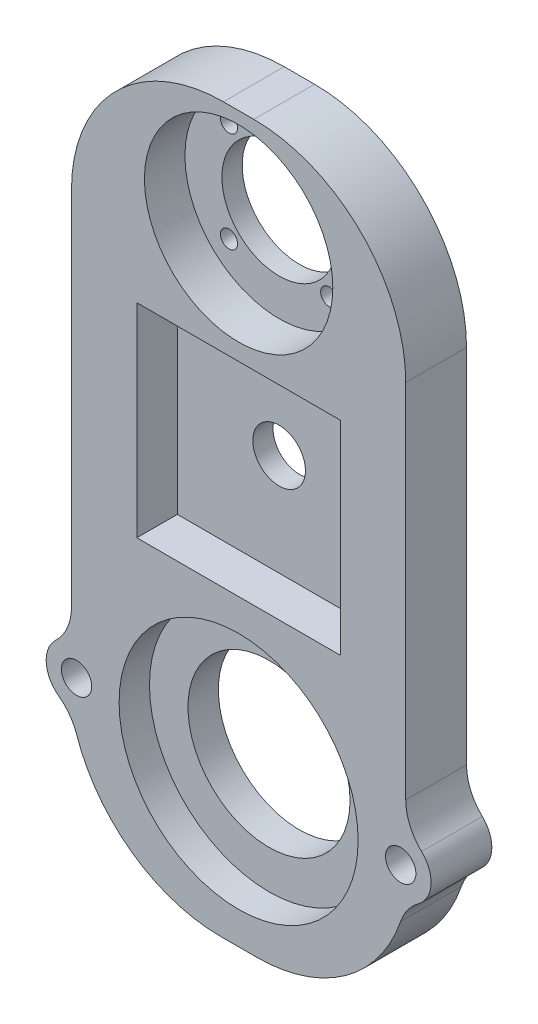
ISO-10303-21;
HEADER;
FILE_DESCRIPTION(('STEP AP214'),'2;1');
FILE_NAME('part.step','',(''),(''),'','','');
FILE_SCHEMA(('AUTOMOTIVE_DESIGN { 1 0 10303 214 1 1 1 1 }'));
ENDSEC;
DATA;
#1=APPLICATION_CONTEXT('core data for automotive mechanical design processes');
#2=APPLICATION_PROTOCOL_DEFINITION('international standard','automotive_design',2000,#1);
#3=PRODUCT_CONTEXT('',#1,'mechanical');
#4=PRODUCT('Part','Part','',(#3));
#5=PRODUCT_RELATED_PRODUCT_CATEGORY('part','',(#4));
#6=PRODUCT_DEFINITION_FORMATION('','',#4);
#7=PRODUCT_DEFINITION_CONTEXT('part definition',#1,'design');
#8=PRODUCT_DEFINITION('design','',#6,#7);
#9=PRODUCT_DEFINITION_SHAPE('','',#8);
#10=(LENGTH_UNIT() NAMED_UNIT(*) SI_UNIT(.MILLI.,.METRE.));
#11=(NAMED_UNIT(*) PLANE_ANGLE_UNIT() SI_UNIT($,.RADIAN.));
#12=(NAMED_UNIT(*) SI_UNIT($,.STERADIAN.) SOLID_ANGLE_UNIT());
#13=UNCERTAINTY_MEASURE_WITH_UNIT(LENGTH_MEASURE(1.E-05),#10,'distance_accuracy_value','');
#14=(GEOMETRIC_REPRESENTATION_CONTEXT(3) GLOBAL_UNCERTAINTY_ASSIGNED_CONTEXT((#13)) GLOBAL_UNIT_ASSIGNED_CONTEXT((#10,
#11,#12)) REPRESENTATION_CONTEXT('',''));
#15=CARTESIAN_POINT('',(0.,0.,0.));
#16=DIRECTION('',(0.,0.,1.));
#17=DIRECTION('',(1.,0.,0.));
#18=AXIS2_PLACEMENT_3D('',#15,#16,#17);
#19=CARTESIAN_POINT('',(33.,113.,12.));
#20=DIRECTION('',(-1.,0.,0.));
#21=DIRECTION('',(0.,-1.,0.));
#22=AXIS2_PLACEMENT_3D('',#19,#20,#21);
#23=PLANE('',#22);
#24=DIRECTION('',(0.,1.,0.));
#25=VECTOR('',#24,1.);
#26=CARTESIAN_POINT('',(33.,113.,12.));
#27=LINE('',#26,#25);
#28=CARTESIAN_POINT('',(33.,11.6189500386222,12.));
#29=VERTEX_POINT('',#28);
#30=CARTESIAN_POINT('',(33.,83.,12.));
#31=VERTEX_POINT('',#30);
#32=EDGE_CURVE('E236',#29,#31,#27,.T.);
#33=ORIENTED_EDGE('',*,*,#32,.F.);
#34=DIRECTION('',(0.,0.,1.));
#35=VECTOR('',#34,1.);
#36=CARTESIAN_POINT('',(33.,11.6189500386222,0.));
#37=LINE('',#36,#35);
#38=CARTESIAN_POINT('',(33.,11.6189500386222,0.));
#39=VERTEX_POINT('',#38);
#40=EDGE_CURVE('E312',#29,#39,#37,.F.);
#41=ORIENTED_EDGE('',*,*,#40,.T.);
#42=DIRECTION('',(0.,1.,0.));
#43=VECTOR('',#42,1.);
#44=CARTESIAN_POINT('',(33.,113.,0.));
#45=LINE('',#44,#43);
#46=CARTESIAN_POINT('',(33.,83.,0.));
#47=VERTEX_POINT('',#46);
#48=EDGE_CURVE('E247',#39,#47,#45,.T.);
#49=ORIENTED_EDGE('',*,*,#48,.T.);
#50=DIRECTION('',(0.,0.,-1.));
#51=VECTOR('',#50,1.);
#52=CARTESIAN_POINT('',(33.,83.,12.));
#53=LINE('',#52,#51);
#54=EDGE_CURVE('E277',#47,#31,#53,.F.);
#55=ORIENTED_EDGE('',*,*,#54,.T.);
#56=EDGE_LOOP('',(#33,#41,#49,#55));
#57=FACE_BOUND('',#56,.T.);
#58=ADVANCED_FACE('F37',(#57),#23,.F.);
#59=CARTESIAN_POINT('',(-33.,113.,12.));
#60=DIRECTION('',(1.,0.,0.));
#61=DIRECTION('',(0.,1.,0.));
#62=AXIS2_PLACEMENT_3D('',#59,#60,#61);
#63=PLANE('',#62);
#64=DIRECTION('',(0.,-1.,0.));
#65=VECTOR('',#64,1.);
#66=CARTESIAN_POINT('',(-33.,113.,0.));
#67=LINE('',#66,#65);
#68=CARTESIAN_POINT('',(-33.,83.,0.));
#69=VERTEX_POINT('',#68);
#70=CARTESIAN_POINT('',(-33.,11.6189500386222,0.));
#71=VERTEX_POINT('',#70);
#72=EDGE_CURVE('E228',#69,#71,#67,.T.);
#73=ORIENTED_EDGE('',*,*,#72,.T.);
#74=DIRECTION('',(0.,0.,1.));
#75=VECTOR('',#74,1.);
#76=CARTESIAN_POINT('',(-33.,11.6189500386222,12.));
#77=LINE('',#76,#75);
#78=CARTESIAN_POINT('',(-33.,11.6189500386222,12.));
#79=VERTEX_POINT('',#78);
#80=EDGE_CURVE('E302',#71,#79,#77,.T.);
#81=ORIENTED_EDGE('',*,*,#80,.T.);
#82=DIRECTION('',(0.,-1.,0.));
#83=VECTOR('',#82,1.);
#84=CARTESIAN_POINT('',(-33.,113.,12.));
#85=LINE('',#84,#83);
#86=CARTESIAN_POINT('',(-33.,83.,12.));
#87=VERTEX_POINT('',#86);
#88=EDGE_CURVE('E229',#87,#79,#85,.T.);
#89=ORIENTED_EDGE('',*,*,#88,.F.);
#90=DIRECTION('',(0.,0.,-1.));
#91=VECTOR('',#90,1.);
#92=CARTESIAN_POINT('',(-33.,83.,12.));
#93=LINE('',#92,#91);
#94=EDGE_CURVE('E288',#87,#69,#93,.T.);
#95=ORIENTED_EDGE('',*,*,#94,.T.);
#96=EDGE_LOOP('',(#73,#81,#89,#95));
#97=FACE_BOUND('',#96,.T.);
#98=ADVANCED_FACE('F365',(#97),#63,.F.);
#99=CARTESIAN_POINT('',(0.,0.,12.));
#100=DIRECTION('',(0.,0.,-1.));
#101=DIRECTION('',(-1.,0.,0.));
#102=AXIS2_PLACEMENT_3D('',#99,#100,#101);
#103=CYLINDRICAL_SURFACE('',#102,16.);
#104=CARTESIAN_POINT('',(0.,0.,0.));
#105=DIRECTION('',(0.,0.,1.));
#106=DIRECTION('',(1.,0.,0.));
#107=AXIS2_PLACEMENT_3D('',#104,#105,#106);
#108=CIRCLE('',#107,16.);
#109=CARTESIAN_POINT('',(16.,0.,0.));
#110=VERTEX_POINT('',#109);
#111=EDGE_CURVE('E225',#110,#110,#108,.T.);
#112=ORIENTED_EDGE('',*,*,#111,.F.);
#113=EDGE_LOOP('',(#112));
#114=FACE_BOUND('',#113,.T.);
#115=CARTESIAN_POINT('',(0.,0.,6.));
#116=DIRECTION('',(0.,0.,1.));
#117=DIRECTION('',(1.,0.,0.));
#118=AXIS2_PLACEMENT_3D('',#115,#116,#117);
#119=CIRCLE('',#118,16.);
#120=CARTESIAN_POINT('',(16.,0.,6.));
#121=VERTEX_POINT('',#120);
#122=EDGE_CURVE('E258',#121,#121,#119,.T.);
#123=ORIENTED_EDGE('',*,*,#122,.T.);
#124=EDGE_LOOP('',(#123));
#125=FACE_BOUND('',#124,.T.);
#126=ADVANCED_FACE('F452',(#114,#125),#103,.F.);
#127=CARTESIAN_POINT('',(0.,92.,12.));
#128=DIRECTION('',(0.,0.,-1.));
#129=DIRECTION('',(-1.,0.,0.));
#130=AXIS2_PLACEMENT_3D('',#127,#128,#129);
#131=CYLINDRICAL_SURFACE('',#130,11.3);
#132=CARTESIAN_POINT('',(0.,92.,0.));
#133=DIRECTION('',(0.,0.,1.));
#134=DIRECTION('',(1.,0.,0.));
#135=AXIS2_PLACEMENT_3D('',#132,#133,#134);
#136=CIRCLE('',#135,11.3);
#137=CARTESIAN_POINT('',(11.3,92.,0.));
#138=VERTEX_POINT('',#137);
#139=EDGE_CURVE('E219',#138,#138,#136,.T.);
#140=ORIENTED_EDGE('',*,*,#139,.F.);
#141=EDGE_LOOP('',(#140));
#142=FACE_BOUND('',#141,.T.);
#143=CARTESIAN_POINT('',(0.,92.,4.));
#144=DIRECTION('',(0.,0.,1.));
#145=DIRECTION('',(1.,0.,0.));
#146=AXIS2_PLACEMENT_3D('',#143,#144,#145);
#147=CIRCLE('',#146,11.3);
#148=CARTESIAN_POINT('',(11.3,92.,4.));
#149=VERTEX_POINT('',#148);
#150=EDGE_CURVE('E191',#149,#149,#147,.T.);
#151=ORIENTED_EDGE('',*,*,#150,.T.);
#152=EDGE_LOOP('',(#151));
#153=FACE_BOUND('',#152,.T.);
#154=ADVANCED_FACE('F403',(#142,#153),#131,.F.);
#155=CARTESIAN_POINT('',(-9.89999999999998,101.9,12.));
#156=DIRECTION('',(0.,0.,-1.));
#157=DIRECTION('',(-1.,0.,0.));
#158=AXIS2_PLACEMENT_3D('',#155,#156,#157);
#159=CYLINDRICAL_SURFACE('',#158,1.7);
#160=CARTESIAN_POINT('',(-9.89999999999998,101.9,0.));
#161=DIRECTION('',(0.,0.,1.));
#162=DIRECTION('',(1.,0.,0.));
#163=AXIS2_PLACEMENT_3D('',#160,#161,#162);
#164=CIRCLE('',#163,1.7);
#165=CARTESIAN_POINT('',(-8.19999999999998,101.9,0.));
#166=VERTEX_POINT('',#165);
#167=EDGE_CURVE('E216',#166,#166,#164,.T.);
#168=ORIENTED_EDGE('',*,*,#167,.F.);
#169=EDGE_LOOP('',(#168));
#170=FACE_BOUND('',#169,.T.);
#171=CARTESIAN_POINT('',(-9.89999999999998,101.9,4.));
#172=DIRECTION('',(0.,0.,1.));
#173=DIRECTION('',(1.,0.,0.));
#174=AXIS2_PLACEMENT_3D('',#171,#172,#173);
#175=CIRCLE('',#174,1.7);
#176=CARTESIAN_POINT('',(-8.19999999999998,101.9,4.));
#177=VERTEX_POINT('',#176);
#178=EDGE_CURVE('E396',#177,#177,#175,.T.);
#179=ORIENTED_EDGE('',*,*,#178,.T.);
#180=EDGE_LOOP('',(#179));
#181=FACE_BOUND('',#180,.T.);
#182=ADVANCED_FACE('F562',(#170,#181),#159,.F.);
#183=CARTESIAN_POINT('',(9.9,101.9,12.));
#184=DIRECTION('',(0.,0.,-1.));
#185=DIRECTION('',(-1.,0.,0.));
#186=AXIS2_PLACEMENT_3D('',#183,#184,#185);
#187=CYLINDRICAL_SURFACE('',#186,1.7);
#188=CARTESIAN_POINT('',(9.9,101.9,0.));
#189=DIRECTION('',(0.,0.,1.));
#190=DIRECTION('',(1.,0.,0.));
#191=AXIS2_PLACEMENT_3D('',#188,#189,#190);
#192=CIRCLE('',#191,1.7);
#193=CARTESIAN_POINT('',(11.6,101.9,0.));
#194=VERTEX_POINT('',#193);
#195=EDGE_CURVE('E213',#194,#194,#192,.T.);
#196=ORIENTED_EDGE('',*,*,#195,.F.);
#197=EDGE_LOOP('',(#196));
#198=FACE_BOUND('',#197,.T.);
#199=CARTESIAN_POINT('',(9.9,101.9,4.));
#200=DIRECTION('',(0.,0.,1.));
#201=DIRECTION('',(1.,0.,0.));
#202=AXIS2_PLACEMENT_3D('',#199,#200,#201);
#203=CIRCLE('',#202,1.7);
#204=CARTESIAN_POINT('',(11.6,101.9,4.));
#205=VERTEX_POINT('',#204);
#206=EDGE_CURVE('E394',#205,#205,#203,.T.);
#207=ORIENTED_EDGE('',*,*,#206,.T.);
#208=EDGE_LOOP('',(#207));
#209=FACE_BOUND('',#208,.T.);
#210=ADVANCED_FACE('F556',(#198,#209),#187,.F.);
#211=CARTESIAN_POINT('',(9.9,82.1,12.));
#212=DIRECTION('',(0.,0.,-1.));
#213=DIRECTION('',(-1.,0.,0.));
#214=AXIS2_PLACEMENT_3D('',#211,#212,#213);
#215=CYLINDRICAL_SURFACE('',#214,1.7);
#216=CARTESIAN_POINT('',(9.9,82.1,0.));
#217=DIRECTION('',(0.,0.,1.));
#218=DIRECTION('',(1.,0.,0.));
#219=AXIS2_PLACEMENT_3D('',#216,#217,#218);
#220=CIRCLE('',#219,1.7);
#221=CARTESIAN_POINT('',(11.6,82.1,0.));
#222=VERTEX_POINT('',#221);
#223=EDGE_CURVE('E210',#222,#222,#220,.T.);
#224=ORIENTED_EDGE('',*,*,#223,.F.);
#225=EDGE_LOOP('',(#224));
#226=FACE_BOUND('',#225,.T.);
#227=CARTESIAN_POINT('',(9.9,82.1,4.));
#228=DIRECTION('',(0.,0.,1.));
#229=DIRECTION('',(1.,0.,0.));
#230=AXIS2_PLACEMENT_3D('',#227,#228,#229);
#231=CIRCLE('',#230,1.7);
#232=CARTESIAN_POINT('',(11.6,82.1,4.));
#233=VERTEX_POINT('',#232);
#234=EDGE_CURVE('E256',#233,#233,#231,.T.);
#235=ORIENTED_EDGE('',*,*,#234,.T.);
#236=EDGE_LOOP('',(#235));
#237=FACE_BOUND('',#236,.T.);
#238=ADVANCED_FACE('F550',(#226,#237),#215,.F.);
#239=CARTESIAN_POINT('',(-9.89999999999998,82.1,12.));
#240=DIRECTION('',(0.,0.,-1.));
#241=DIRECTION('',(-1.,0.,0.));
#242=AXIS2_PLACEMENT_3D('',#239,#240,#241);
#243=CYLINDRICAL_SURFACE('',#242,1.7);
#244=CARTESIAN_POINT('',(-9.89999999999998,82.1,0.));
#245=DIRECTION('',(0.,0.,1.));
#246=DIRECTION('',(1.,0.,0.));
#247=AXIS2_PLACEMENT_3D('',#244,#245,#246);
#248=CIRCLE('',#247,1.7);
#249=CARTESIAN_POINT('',(-8.19999999999998,82.1,0.));
#250=VERTEX_POINT('',#249);
#251=EDGE_CURVE('E207',#250,#250,#248,.T.);
#252=ORIENTED_EDGE('',*,*,#251,.F.);
#253=EDGE_LOOP('',(#252));
#254=FACE_BOUND('',#253,.T.);
#255=CARTESIAN_POINT('',(-9.89999999999998,82.1,4.));
#256=DIRECTION('',(0.,0.,1.));
#257=DIRECTION('',(1.,0.,0.));
#258=AXIS2_PLACEMENT_3D('',#255,#256,#257);
#259=CIRCLE('',#258,1.7);
#260=CARTESIAN_POINT('',(-8.19999999999998,82.1,4.));
#261=VERTEX_POINT('',#260);
#262=EDGE_CURVE('E253',#261,#261,#259,.T.);
#263=ORIENTED_EDGE('',*,*,#262,.T.);
#264=EDGE_LOOP('',(#263));
#265=FACE_BOUND('',#264,.T.);
#266=ADVANCED_FACE('F427',(#254,#265),#243,.F.);
#267=CARTESIAN_POINT('',(0.,0.,12.));
#268=DIRECTION('',(0.,0.,1.));
#269=DIRECTION('',(1.,0.,0.));
#270=AXIS2_PLACEMENT_3D('',#267,#268,#269);
#271=PLANE('',#270);
#272=CARTESIAN_POINT('',(-32.,0.,12.));
#273=DIRECTION('',(0.,0.,1.));
#274=DIRECTION('',(1.,0.,0.));
#275=AXIS2_PLACEMENT_3D('',#272,#273,#274);
#276=CIRCLE('',#275,3.);
#277=CARTESIAN_POINT('',(-29.,0.,12.));
#278=VERTEX_POINT('',#277);
#279=EDGE_CURVE('E496',#278,#278,#276,.T.);
#280=ORIENTED_EDGE('',*,*,#279,.F.);
#281=EDGE_LOOP('',(#280));
#282=FACE_BOUND('',#281,.T.);
#283=CARTESIAN_POINT('',(32.,0.,12.));
#284=DIRECTION('',(0.,0.,1.));
#285=DIRECTION('',(1.,0.,0.));
#286=AXIS2_PLACEMENT_3D('',#283,#284,#285);
#287=CIRCLE('',#286,3.);
#288=CARTESIAN_POINT('',(35.,0.,12.));
#289=VERTEX_POINT('',#288);
#290=EDGE_CURVE('E486',#289,#289,#287,.T.);
#291=ORIENTED_EDGE('',*,*,#290,.F.);
#292=EDGE_LOOP('',(#291));
#293=FACE_BOUND('',#292,.T.);
#294=CARTESIAN_POINT('',(0.,0.,12.));
#295=DIRECTION('',(0.,0.,1.));
#296=DIRECTION('',(1.,0.,0.));
#297=AXIS2_PLACEMENT_3D('',#294,#295,#296);
#298=CIRCLE('',#297,23.6);
#299=CARTESIAN_POINT('',(23.6,0.,12.));
#300=VERTEX_POINT('',#299);
#301=EDGE_CURVE('E379',#300,#300,#298,.T.);
#302=ORIENTED_EDGE('',*,*,#301,.F.);
#303=EDGE_LOOP('',(#302));
#304=FACE_BOUND('',#303,.T.);
#305=CARTESIAN_POINT('',(0.,92.,12.));
#306=DIRECTION('',(0.,0.,1.));
#307=DIRECTION('',(1.,0.,0.));
#308=AXIS2_PLACEMENT_3D('',#305,#306,#307);
#309=CIRCLE('',#308,18.6);
#310=CARTESIAN_POINT('',(18.6,92.,12.));
#311=VERTEX_POINT('',#310);
#312=EDGE_CURVE('E261',#311,#311,#309,.T.);
#313=ORIENTED_EDGE('',*,*,#312,.F.);
#314=EDGE_LOOP('',(#313));
#315=FACE_BOUND('',#314,.T.);
#316=DIRECTION('',(0.,1.,0.));
#317=VECTOR('',#316,1.);
#318=CARTESIAN_POINT('',(20.1,70.1,12.));
#319=LINE('',#318,#317);
#320=CARTESIAN_POINT('',(20.1,29.9,12.));
#321=VERTEX_POINT('',#320);
#322=CARTESIAN_POINT('',(20.1,70.1,12.));
#323=VERTEX_POINT('',#322);
#324=EDGE_CURVE('E168',#321,#323,#319,.T.);
#325=ORIENTED_EDGE('',*,*,#324,.F.);
#326=DIRECTION('',(1.,0.,0.));
#327=VECTOR('',#326,1.);
#328=CARTESIAN_POINT('',(20.1,29.9,12.));
#329=LINE('',#328,#327);
#330=CARTESIAN_POINT('',(-20.1,29.9,12.));
#331=VERTEX_POINT('',#330);
#332=EDGE_CURVE('E185',#331,#321,#329,.T.);
#333=ORIENTED_EDGE('',*,*,#332,.F.);
#334=DIRECTION('',(0.,-1.,0.));
#335=VECTOR('',#334,1.);
#336=CARTESIAN_POINT('',(-20.1,70.1,12.));
#337=LINE('',#336,#335);
#338=CARTESIAN_POINT('',(-20.1,70.1,12.));
#339=VERTEX_POINT('',#338);
#340=EDGE_CURVE('E188',#339,#331,#337,.T.);
#341=ORIENTED_EDGE('',*,*,#340,.F.);
#342=DIRECTION('',(-1.,0.,0.));
#343=VECTOR('',#342,1.);
#344=CARTESIAN_POINT('',(20.1,70.1,12.));
#345=LINE('',#344,#343);
#346=EDGE_CURVE('E197',#323,#339,#345,.T.);
#347=ORIENTED_EDGE('',*,*,#346,.F.);
#348=EDGE_LOOP('',(#325,#333,#341,#347));
#349=FACE_BOUND('',#348,.T.);
#350=CARTESIAN_POINT('',(32.,0.,12.));
#351=DIRECTION('',(0.,0.,1.));
#352=DIRECTION('',(1.,0.,0.));
#353=AXIS2_PLACEMENT_3D('',#350,#351,#352);
#354=CIRCLE('',#353,6.);
#355=CARTESIAN_POINT('',(35.5428002437193,-4.84237198417287,12.));
#356=VERTEX_POINT('',#355);
#357=CARTESIAN_POINT('',(36.125,4.35710626448334,12.));
#358=VERTEX_POINT('',#357);
#359=EDGE_CURVE('E342',#356,#358,#354,.T.);
#360=ORIENTED_EDGE('',*,*,#359,.T.);
#361=CARTESIAN_POINT('',(43.,11.6189500386222,12.));
#362=DIRECTION('',(0.,0.,1.));
#363=DIRECTION('',(1.,0.,0.));
#364=AXIS2_PLACEMENT_3D('',#361,#362,#363);
#365=CIRCLE('',#364,10.);
#366=EDGE_CURVE('E323',#358,#29,#365,.F.);
#367=ORIENTED_EDGE('',*,*,#366,.T.);
#368=ORIENTED_EDGE('',*,*,#32,.T.);
#369=CARTESIAN_POINT('',(3.00000000000002,83.,12.));
#370=DIRECTION('',(0.,0.,1.));
#371=DIRECTION('',(1.,0.,0.));
#372=AXIS2_PLACEMENT_3D('',#369,#370,#371);
#373=CIRCLE('',#372,30.);
#374=CARTESIAN_POINT('',(3.00000000000002,113.,12.));
#375=VERTEX_POINT('',#374);
#376=EDGE_CURVE('E286',#31,#375,#373,.T.);
#377=ORIENTED_EDGE('',*,*,#376,.T.);
#378=DIRECTION('',(-1.,0.,0.));
#379=VECTOR('',#378,1.);
#380=CARTESIAN_POINT('',(-33.,113.,12.));
#381=LINE('',#380,#379);
#382=CARTESIAN_POINT('',(-3.00000000000002,113.,12.));
#383=VERTEX_POINT('',#382);
#384=EDGE_CURVE('E238',#375,#383,#381,.T.);
#385=ORIENTED_EDGE('',*,*,#384,.T.);
#386=CARTESIAN_POINT('',(-3.00000000000002,83.,12.));
#387=DIRECTION('',(0.,0.,1.));
#388=DIRECTION('',(1.,0.,0.));
#389=AXIS2_PLACEMENT_3D('',#386,#387,#388);
#390=CIRCLE('',#389,30.);
#391=EDGE_CURVE('E284',#383,#87,#390,.T.);
#392=ORIENTED_EDGE('',*,*,#391,.T.);
#393=ORIENTED_EDGE('',*,*,#88,.T.);
#394=CARTESIAN_POINT('',(-43.,11.6189500386222,12.));
#395=DIRECTION('',(0.,0.,1.));
#396=DIRECTION('',(1.,0.,0.));
#397=AXIS2_PLACEMENT_3D('',#394,#395,#396);
#398=CIRCLE('',#397,10.);
#399=CARTESIAN_POINT('',(-36.125,4.35710626448334,12.));
#400=VERTEX_POINT('',#399);
#401=EDGE_CURVE('E317',#79,#400,#398,.F.);
#402=ORIENTED_EDGE('',*,*,#401,.T.);
#403=CARTESIAN_POINT('',(-32.,0.,12.));
#404=DIRECTION('',(0.,0.,1.));
#405=DIRECTION('',(1.,0.,0.));
#406=AXIS2_PLACEMENT_3D('',#403,#404,#405);
#407=CIRCLE('',#406,6.);
#408=CARTESIAN_POINT('',(-35.5428002437193,-4.84237198417287,12.));
#409=VERTEX_POINT('',#408);
#410=EDGE_CURVE('E373',#400,#409,#407,.T.);
#411=ORIENTED_EDGE('',*,*,#410,.T.);
#412=CARTESIAN_POINT('',(-41.4474673165849,-12.9129919577943,12.));
#413=DIRECTION('',(0.,0.,1.));
#414=DIRECTION('',(1.,0.,0.));
#415=AXIS2_PLACEMENT_3D('',#412,#413,#414);
#416=CIRCLE('',#415,10.);
#417=CARTESIAN_POINT('',(-31.9828799025123,-9.68474396834574,12.));
#418=VERTEX_POINT('',#417);
#419=EDGE_CURVE('E319',#409,#418,#416,.F.);
#420=ORIENTED_EDGE('',*,*,#419,.T.);
#421=CARTESIAN_POINT('',(-3.58911766029452,0.,12.));
#422=DIRECTION('',(0.,0.,1.));
#423=DIRECTION('',(1.,0.,0.));
#424=AXIS2_PLACEMENT_3D('',#421,#422,#423);
#425=CIRCLE('',#424,30.);
#426=CARTESIAN_POINT('',(-3.58911766029452,-30.,12.));
#427=VERTEX_POINT('',#426);
#428=EDGE_CURVE('E280',#418,#427,#425,.T.);
#429=ORIENTED_EDGE('',*,*,#428,.T.);
#430=DIRECTION('',(1.,0.,0.));
#431=VECTOR('',#430,1.);
#432=CARTESIAN_POINT('',(-33.,-30.,12.));
#433=LINE('',#432,#431);
#434=CARTESIAN_POINT('',(3.58911766029453,-30.,12.));
#435=VERTEX_POINT('',#434);
#436=EDGE_CURVE('E232',#427,#435,#433,.T.);
#437=ORIENTED_EDGE('',*,*,#436,.T.);
#438=CARTESIAN_POINT('',(3.58911766029453,0.,12.));
#439=DIRECTION('',(0.,0.,1.));
#440=DIRECTION('',(1.,0.,0.));
#441=AXIS2_PLACEMENT_3D('',#438,#439,#440);
#442=CIRCLE('',#441,30.);
#443=CARTESIAN_POINT('',(31.9828799025123,-9.68474396834573,12.));
#444=VERTEX_POINT('',#443);
#445=EDGE_CURVE('E282',#435,#444,#442,.T.);
#446=ORIENTED_EDGE('',*,*,#445,.T.);
#447=CARTESIAN_POINT('',(41.4474673165849,-12.9129919577943,12.));
#448=DIRECTION('',(0.,0.,1.));
#449=DIRECTION('',(1.,0.,0.));
#450=AXIS2_PLACEMENT_3D('',#447,#448,#449);
#451=CIRCLE('',#450,10.);
#452=EDGE_CURVE('E11',#444,#356,#451,.F.);
#453=ORIENTED_EDGE('',*,*,#452,.T.);
#454=EDGE_LOOP('',(#360,#367,#368,#377,#385,#392,#393,#402,#411,#420,#429,#437,#446,#453));
#455=FACE_BOUND('',#454,.T.);
#456=ADVANCED_FACE('F347',(#282,#293,#304,#315,#349,#455),#271,.T.);
#457=CARTESIAN_POINT('',(0.,0.,0.));
#458=DIRECTION('',(0.,0.,1.));
#459=DIRECTION('',(1.,0.,0.));
#460=AXIS2_PLACEMENT_3D('',#457,#458,#459);
#461=PLANE('',#460);
#462=CARTESIAN_POINT('',(-32.,0.,0.));
#463=DIRECTION('',(0.,0.,1.));
#464=DIRECTION('',(1.,0.,0.));
#465=AXIS2_PLACEMENT_3D('',#462,#463,#464);
#466=CIRCLE('',#465,3.);
#467=CARTESIAN_POINT('',(-29.,0.,0.));
#468=VERTEX_POINT('',#467);
#469=EDGE_CURVE('E493',#468,#468,#466,.T.);
#470=ORIENTED_EDGE('',*,*,#469,.T.);
#471=EDGE_LOOP('',(#470));
#472=FACE_BOUND('',#471,.T.);
#473=CARTESIAN_POINT('',(32.,0.,0.));
#474=DIRECTION('',(0.,0.,1.));
#475=DIRECTION('',(1.,0.,0.));
#476=AXIS2_PLACEMENT_3D('',#473,#474,#475);
#477=CIRCLE('',#476,3.);
#478=CARTESIAN_POINT('',(35.,0.,0.));
#479=VERTEX_POINT('',#478);
#480=EDGE_CURVE('E488',#479,#479,#477,.T.);
#481=ORIENTED_EDGE('',*,*,#480,.T.);
#482=EDGE_LOOP('',(#481));
#483=FACE_BOUND('',#482,.T.);
#484=DIRECTION('',(-1.,0.,0.));
#485=VECTOR('',#484,1.);
#486=CARTESIAN_POINT('',(-33.,113.,0.));
#487=LINE('',#486,#485);
#488=CARTESIAN_POINT('',(3.00000000000002,113.,0.));
#489=VERTEX_POINT('',#488);
#490=CARTESIAN_POINT('',(-3.00000000000002,113.,0.));
#491=VERTEX_POINT('',#490);
#492=EDGE_CURVE('E233',#489,#491,#487,.T.);
#493=ORIENTED_EDGE('',*,*,#492,.F.);
#494=CARTESIAN_POINT('',(3.00000000000002,83.,0.));
#495=DIRECTION('',(0.,0.,1.));
#496=DIRECTION('',(1.,0.,0.));
#497=AXIS2_PLACEMENT_3D('',#494,#495,#496);
#498=CIRCLE('',#497,30.);
#499=EDGE_CURVE('E274',#489,#47,#498,.F.);
#500=ORIENTED_EDGE('',*,*,#499,.T.);
#501=ORIENTED_EDGE('',*,*,#48,.F.);
#502=CARTESIAN_POINT('',(43.,11.6189500386222,0.));
#503=DIRECTION('',(0.,0.,1.));
#504=DIRECTION('',(1.,0.,0.));
#505=AXIS2_PLACEMENT_3D('',#502,#503,#504);
#506=CIRCLE('',#505,10.);
#507=CARTESIAN_POINT('',(36.125,4.35710626448334,0.));
#508=VERTEX_POINT('',#507);
#509=EDGE_CURVE('E325',#39,#508,#506,.T.);
#510=ORIENTED_EDGE('',*,*,#509,.T.);
#511=CARTESIAN_POINT('',(32.,0.,0.));
#512=DIRECTION('',(0.,0.,1.));
#513=DIRECTION('',(1.,0.,0.));
#514=AXIS2_PLACEMENT_3D('',#511,#512,#513);
#515=CIRCLE('',#514,6.);
#516=CARTESIAN_POINT('',(35.5428002437193,-4.84237198417287,0.));
#517=VERTEX_POINT('',#516);
#518=EDGE_CURVE('E332',#517,#508,#515,.T.);
#519=ORIENTED_EDGE('',*,*,#518,.F.);
#520=CARTESIAN_POINT('',(41.4474673165849,-12.9129919577943,0.));
#521=DIRECTION('',(0.,0.,1.));
#522=DIRECTION('',(1.,0.,0.));
#523=AXIS2_PLACEMENT_3D('',#520,#521,#522);
#524=CIRCLE('',#523,10.);
#525=CARTESIAN_POINT('',(31.9828799025123,-9.68474396834573,0.));
#526=VERTEX_POINT('',#525);
#527=EDGE_CURVE('E45',#517,#526,#524,.T.);
#528=ORIENTED_EDGE('',*,*,#527,.T.);
#529=CARTESIAN_POINT('',(3.58911766029453,0.,0.));
#530=DIRECTION('',(0.,0.,1.));
#531=DIRECTION('',(1.,0.,0.));
#532=AXIS2_PLACEMENT_3D('',#529,#530,#531);
#533=CIRCLE('',#532,30.);
#534=CARTESIAN_POINT('',(3.58911766029453,-30.,0.));
#535=VERTEX_POINT('',#534);
#536=EDGE_CURVE('E270',#526,#535,#533,.F.);
#537=ORIENTED_EDGE('',*,*,#536,.T.);
#538=DIRECTION('',(1.,0.,0.));
#539=VECTOR('',#538,1.);
#540=CARTESIAN_POINT('',(-33.,-30.,0.));
#541=LINE('',#540,#539);
#542=CARTESIAN_POINT('',(-3.58911766029452,-30.,0.));
#543=VERTEX_POINT('',#542);
#544=EDGE_CURVE('E244',#543,#535,#541,.T.);
#545=ORIENTED_EDGE('',*,*,#544,.F.);
#546=CARTESIAN_POINT('',(-3.58911766029452,0.,0.));
#547=DIRECTION('',(0.,0.,1.));
#548=DIRECTION('',(1.,0.,0.));
#549=AXIS2_PLACEMENT_3D('',#546,#547,#548);
#550=CIRCLE('',#549,30.);
#551=CARTESIAN_POINT('',(-31.9828799025123,-9.68474396834574,0.));
#552=VERTEX_POINT('',#551);
#553=EDGE_CURVE('E267',#543,#552,#550,.F.);
#554=ORIENTED_EDGE('',*,*,#553,.T.);
#555=CARTESIAN_POINT('',(-41.4474673165849,-12.9129919577943,0.));
#556=DIRECTION('',(0.,0.,1.));
#557=DIRECTION('',(1.,0.,0.));
#558=AXIS2_PLACEMENT_3D('',#555,#556,#557);
#559=CIRCLE('',#558,10.);
#560=CARTESIAN_POINT('',(-35.5428002437193,-4.84237198417287,0.));
#561=VERTEX_POINT('',#560);
#562=EDGE_CURVE('E321',#552,#561,#559,.T.);
#563=ORIENTED_EDGE('',*,*,#562,.T.);
#564=CARTESIAN_POINT('',(-32.,0.,0.));
#565=DIRECTION('',(0.,0.,1.));
#566=DIRECTION('',(1.,0.,0.));
#567=AXIS2_PLACEMENT_3D('',#564,#565,#566);
#568=CIRCLE('',#567,6.);
#569=CARTESIAN_POINT('',(-36.125,4.35710626448334,0.));
#570=VERTEX_POINT('',#569);
#571=EDGE_CURVE('E341',#570,#561,#568,.T.);
#572=ORIENTED_EDGE('',*,*,#571,.F.);
#573=CARTESIAN_POINT('',(-43.,11.6189500386222,0.));
#574=DIRECTION('',(0.,0.,1.));
#575=DIRECTION('',(1.,0.,0.));
#576=AXIS2_PLACEMENT_3D('',#573,#574,#575);
#577=CIRCLE('',#576,10.);
#578=EDGE_CURVE('E315',#570,#71,#577,.T.);
#579=ORIENTED_EDGE('',*,*,#578,.T.);
#580=ORIENTED_EDGE('',*,*,#72,.F.);
#581=CARTESIAN_POINT('',(-3.00000000000002,83.,0.));
#582=DIRECTION('',(0.,0.,1.));
#583=DIRECTION('',(1.,0.,0.));
#584=AXIS2_PLACEMENT_3D('',#581,#582,#583);
#585=CIRCLE('',#584,30.);
#586=EDGE_CURVE('E272',#69,#491,#585,.F.);
#587=ORIENTED_EDGE('',*,*,#586,.T.);
#588=EDGE_LOOP('',(#493,#500,#501,#510,#519,#528,#537,#545,#554,#563,#572,#579,#580,#587));
#589=FACE_BOUND('',#588,.T.);
#590=ORIENTED_EDGE('',*,*,#111,.T.);
#591=EDGE_LOOP('',(#590));
#592=FACE_BOUND('',#591,.T.);
#593=CARTESIAN_POINT('',(0.,50.,0.));
#594=DIRECTION('',(0.,0.,1.));
#595=DIRECTION('',(1.,0.,0.));
#596=AXIS2_PLACEMENT_3D('',#593,#594,#595);
#597=CIRCLE('',#596,5.2);
#598=CARTESIAN_POINT('',(5.2,50.,0.));
#599=VERTEX_POINT('',#598);
#600=EDGE_CURVE('E222',#599,#599,#597,.T.);
#601=ORIENTED_EDGE('',*,*,#600,.T.);
#602=EDGE_LOOP('',(#601));
#603=FACE_BOUND('',#602,.T.);
#604=ORIENTED_EDGE('',*,*,#139,.T.);
#605=EDGE_LOOP('',(#604));
#606=FACE_BOUND('',#605,.T.);
#607=ORIENTED_EDGE('',*,*,#167,.T.);
#608=EDGE_LOOP('',(#607));
#609=FACE_BOUND('',#608,.T.);
#610=ORIENTED_EDGE('',*,*,#195,.T.);
#611=EDGE_LOOP('',(#610));
#612=FACE_BOUND('',#611,.T.);
#613=ORIENTED_EDGE('',*,*,#223,.T.);
#614=EDGE_LOOP('',(#613));
#615=FACE_BOUND('',#614,.T.);
#616=ORIENTED_EDGE('',*,*,#251,.T.);
#617=EDGE_LOOP('',(#616));
#618=FACE_BOUND('',#617,.T.);
#619=ADVANCED_FACE('F330',(#472,#483,#589,#592,#603,#606,#609,#612,#615,#618),#461,.F.);
#620=CARTESIAN_POINT('',(-33.,-30.,12.));
#621=DIRECTION('',(0.,1.,0.));
#622=DIRECTION('',(0.,0.,1.));
#623=AXIS2_PLACEMENT_3D('',#620,#621,#622);
#624=PLANE('',#623);
#625=ORIENTED_EDGE('',*,*,#544,.T.);
#626=DIRECTION('',(0.,0.,-1.));
#627=VECTOR('',#626,1.);
#628=CARTESIAN_POINT('',(3.58911766029453,-30.,12.));
#629=LINE('',#628,#627);
#630=EDGE_CURVE('E294',#535,#435,#629,.F.);
#631=ORIENTED_EDGE('',*,*,#630,.T.);
#632=ORIENTED_EDGE('',*,*,#436,.F.);
#633=DIRECTION('',(0.,0.,-1.));
#634=VECTOR('',#633,1.);
#635=CARTESIAN_POINT('',(-3.58911766029452,-30.,12.));
#636=LINE('',#635,#634);
#637=EDGE_CURVE('E291',#427,#543,#636,.T.);
#638=ORIENTED_EDGE('',*,*,#637,.T.);
#639=EDGE_LOOP('',(#625,#631,#632,#638));
#640=FACE_BOUND('',#639,.T.);
#641=ADVANCED_FACE('F457',(#640),#624,.F.);
#642=CARTESIAN_POINT('',(-33.,113.,12.));
#643=DIRECTION('',(0.,-1.,0.));
#644=DIRECTION('',(0.,0.,-1.));
#645=AXIS2_PLACEMENT_3D('',#642,#643,#644);
#646=PLANE('',#645);
#647=ORIENTED_EDGE('',*,*,#384,.F.);
#648=DIRECTION('',(0.,0.,-1.));
#649=VECTOR('',#648,1.);
#650=CARTESIAN_POINT('',(3.00000000000002,113.,12.));
#651=LINE('',#650,#649);
#652=EDGE_CURVE('E264',#375,#489,#651,.T.);
#653=ORIENTED_EDGE('',*,*,#652,.T.);
#654=ORIENTED_EDGE('',*,*,#492,.T.);
#655=DIRECTION('',(0.,0.,-1.));
#656=VECTOR('',#655,1.);
#657=CARTESIAN_POINT('',(-3.00000000000002,113.,12.));
#658=LINE('',#657,#656);
#659=EDGE_CURVE('E241',#491,#383,#658,.F.);
#660=ORIENTED_EDGE('',*,*,#659,.T.);
#661=EDGE_LOOP('',(#647,#653,#654,#660));
#662=FACE_BOUND('',#661,.T.);
#663=ADVANCED_FACE('F357',(#662),#646,.F.);
#664=CARTESIAN_POINT('',(0.,50.,12.));
#665=DIRECTION('',(0.,0.,-1.));
#666=DIRECTION('',(-1.,0.,0.));
#667=AXIS2_PLACEMENT_3D('',#664,#665,#666);
#668=CYLINDRICAL_SURFACE('',#667,5.2);
#669=CARTESIAN_POINT('',(0.,50.,4.));
#670=DIRECTION('',(0.,0.,-1.));
#671=DIRECTION('',(-1.,0.,0.));
#672=AXIS2_PLACEMENT_3D('',#669,#670,#671);
#673=CIRCLE('',#672,5.2);
#674=CARTESIAN_POINT('',(-5.2,50.,4.));
#675=VERTEX_POINT('',#674);
#676=EDGE_CURVE('E203',#675,#675,#673,.T.);
#677=ORIENTED_EDGE('',*,*,#676,.F.);
#678=EDGE_LOOP('',(#677));
#679=FACE_BOUND('',#678,.T.);
#680=ORIENTED_EDGE('',*,*,#600,.F.);
#681=EDGE_LOOP('',(#680));
#682=FACE_BOUND('',#681,.T.);
#683=ADVANCED_FACE('F443',(#679,#682),#668,.F.);
#684=CARTESIAN_POINT('',(20.1,70.1,4.));
#685=DIRECTION('',(1.,0.,0.));
#686=DIRECTION('',(0.,0.,-1.));
#687=AXIS2_PLACEMENT_3D('',#684,#685,#686);
#688=PLANE('',#687);
#689=ORIENTED_EDGE('',*,*,#324,.T.);
#690=DIRECTION('',(0.,0.,1.));
#691=VECTOR('',#690,1.);
#692=CARTESIAN_POINT('',(20.1,70.1,4.));
#693=LINE('',#692,#691);
#694=CARTESIAN_POINT('',(20.1,70.1,4.));
#695=VERTEX_POINT('',#694);
#696=EDGE_CURVE('E161',#695,#323,#693,.T.);
#697=ORIENTED_EDGE('',*,*,#696,.F.);
#698=DIRECTION('',(0.,1.,0.));
#699=VECTOR('',#698,1.);
#700=CARTESIAN_POINT('',(20.1,70.1,4.));
#701=LINE('',#700,#699);
#702=CARTESIAN_POINT('',(20.1,29.9,4.));
#703=VERTEX_POINT('',#702);
#704=EDGE_CURVE('E165',#703,#695,#701,.T.);
#705=ORIENTED_EDGE('',*,*,#704,.F.);
#706=DIRECTION('',(0.,0.,1.));
#707=VECTOR('',#706,1.);
#708=CARTESIAN_POINT('',(20.1,29.9,4.));
#709=LINE('',#708,#707);
#710=EDGE_CURVE('E201',#703,#321,#709,.T.);
#711=ORIENTED_EDGE('',*,*,#710,.T.);
#712=EDGE_LOOP('',(#689,#697,#705,#711));
#713=FACE_BOUND('',#712,.T.);
#714=ADVANCED_FACE('F163',(#713),#688,.F.);
#715=CARTESIAN_POINT('',(20.1,29.9,4.));
#716=DIRECTION('',(0.,-1.,0.));
#717=DIRECTION('',(0.,0.,-1.));
#718=AXIS2_PLACEMENT_3D('',#715,#716,#717);
#719=PLANE('',#718);
#720=ORIENTED_EDGE('',*,*,#332,.T.);
#721=ORIENTED_EDGE('',*,*,#710,.F.);
#722=DIRECTION('',(1.,0.,0.));
#723=VECTOR('',#722,1.);
#724=CARTESIAN_POINT('',(20.1,29.9,4.));
#725=LINE('',#724,#723);
#726=CARTESIAN_POINT('',(-20.1,29.9,4.));
#727=VERTEX_POINT('',#726);
#728=EDGE_CURVE('E173',#727,#703,#725,.T.);
#729=ORIENTED_EDGE('',*,*,#728,.F.);
#730=DIRECTION('',(0.,0.,1.));
#731=VECTOR('',#730,1.);
#732=CARTESIAN_POINT('',(-20.1,29.9,4.));
#733=LINE('',#732,#731);
#734=EDGE_CURVE('E204',#727,#331,#733,.T.);
#735=ORIENTED_EDGE('',*,*,#734,.T.);
#736=EDGE_LOOP('',(#720,#721,#729,#735));
#737=FACE_BOUND('',#736,.T.);
#738=ADVANCED_FACE('F435',(#737),#719,.F.);
#739=CARTESIAN_POINT('',(-20.1,70.1,4.));
#740=DIRECTION('',(-1.,0.,0.));
#741=DIRECTION('',(0.,0.,1.));
#742=AXIS2_PLACEMENT_3D('',#739,#740,#741);
#743=PLANE('',#742);
#744=ORIENTED_EDGE('',*,*,#340,.T.);
#745=ORIENTED_EDGE('',*,*,#734,.F.);
#746=DIRECTION('',(0.,-1.,0.));
#747=VECTOR('',#746,1.);
#748=CARTESIAN_POINT('',(-20.1,70.1,4.));
#749=LINE('',#748,#747);
#750=CARTESIAN_POINT('',(-20.1,70.1,4.));
#751=VERTEX_POINT('',#750);
#752=EDGE_CURVE('E181',#751,#727,#749,.T.);
#753=ORIENTED_EDGE('',*,*,#752,.F.);
#754=DIRECTION('',(0.,0.,1.));
#755=VECTOR('',#754,1.);
#756=CARTESIAN_POINT('',(-20.1,70.1,4.));
#757=LINE('',#756,#755);
#758=EDGE_CURVE('E172',#751,#339,#757,.T.);
#759=ORIENTED_EDGE('',*,*,#758,.T.);
#760=EDGE_LOOP('',(#744,#745,#753,#759));
#761=FACE_BOUND('',#760,.T.);
#762=ADVANCED_FACE('F433',(#761),#743,.F.);
#763=CARTESIAN_POINT('',(20.1,70.1,4.));
#764=DIRECTION('',(0.,1.,0.));
#765=DIRECTION('',(0.,0.,1.));
#766=AXIS2_PLACEMENT_3D('',#763,#764,#765);
#767=PLANE('',#766);
#768=ORIENTED_EDGE('',*,*,#346,.T.);
#769=ORIENTED_EDGE('',*,*,#758,.F.);
#770=DIRECTION('',(-1.,0.,0.));
#771=VECTOR('',#770,1.);
#772=CARTESIAN_POINT('',(20.1,70.1,4.));
#773=LINE('',#772,#771);
#774=EDGE_CURVE('E176',#695,#751,#773,.T.);
#775=ORIENTED_EDGE('',*,*,#774,.F.);
#776=ORIENTED_EDGE('',*,*,#696,.T.);
#777=EDGE_LOOP('',(#768,#769,#775,#776));
#778=FACE_BOUND('',#777,.T.);
#779=ADVANCED_FACE('F177',(#778),#767,.F.);
#780=CARTESIAN_POINT('',(0.,0.,4.));
#781=DIRECTION('',(0.,0.,-1.));
#782=DIRECTION('',(-1.,0.,0.));
#783=AXIS2_PLACEMENT_3D('',#780,#781,#782);
#784=PLANE('',#783);
#785=ORIENTED_EDGE('',*,*,#676,.T.);
#786=EDGE_LOOP('',(#785));
#787=FACE_BOUND('',#786,.T.);
#788=ORIENTED_EDGE('',*,*,#704,.T.);
#789=ORIENTED_EDGE('',*,*,#774,.T.);
#790=ORIENTED_EDGE('',*,*,#752,.T.);
#791=ORIENTED_EDGE('',*,*,#728,.T.);
#792=EDGE_LOOP('',(#788,#789,#790,#791));
#793=FACE_BOUND('',#792,.T.);
#794=ADVANCED_FACE('F183',(#787,#793),#784,.F.);
#795=CARTESIAN_POINT('',(0.,92.,4.));
#796=DIRECTION('',(0.,0.,1.));
#797=DIRECTION('',(1.,0.,0.));
#798=AXIS2_PLACEMENT_3D('',#795,#796,#797);
#799=CYLINDRICAL_SURFACE('',#798,18.6);
#800=CARTESIAN_POINT('',(0.,92.,4.));
#801=DIRECTION('',(0.,0.,1.));
#802=DIRECTION('',(1.,0.,0.));
#803=AXIS2_PLACEMENT_3D('',#800,#801,#802);
#804=CIRCLE('',#803,18.6);
#805=CARTESIAN_POINT('',(18.6,92.,4.));
#806=VERTEX_POINT('',#805);
#807=EDGE_CURVE('E257',#806,#806,#804,.T.);
#808=ORIENTED_EDGE('',*,*,#807,.F.);
#809=EDGE_LOOP('',(#808));
#810=FACE_BOUND('',#809,.T.);
#811=ORIENTED_EDGE('',*,*,#312,.T.);
#812=EDGE_LOOP('',(#811));
#813=FACE_BOUND('',#812,.T.);
#814=ADVANCED_FACE('F409',(#810,#813),#799,.F.);
#815=CARTESIAN_POINT('',(0.,92.,4.));
#816=DIRECTION('',(0.,0.,1.));
#817=DIRECTION('',(1.,0.,0.));
#818=AXIS2_PLACEMENT_3D('',#815,#816,#817);
#819=PLANE('',#818);
#820=ORIENTED_EDGE('',*,*,#150,.F.);
#821=EDGE_LOOP('',(#820));
#822=FACE_BOUND('',#821,.T.);
#823=ORIENTED_EDGE('',*,*,#178,.F.);
#824=EDGE_LOOP('',(#823));
#825=FACE_BOUND('',#824,.T.);
#826=ORIENTED_EDGE('',*,*,#206,.F.);
#827=EDGE_LOOP('',(#826));
#828=FACE_BOUND('',#827,.T.);
#829=ORIENTED_EDGE('',*,*,#234,.F.);
#830=EDGE_LOOP('',(#829));
#831=FACE_BOUND('',#830,.T.);
#832=ORIENTED_EDGE('',*,*,#262,.F.);
#833=EDGE_LOOP('',(#832));
#834=FACE_BOUND('',#833,.T.);
#835=ORIENTED_EDGE('',*,*,#807,.T.);
#836=EDGE_LOOP('',(#835));
#837=FACE_BOUND('',#836,.T.);
#838=ADVANCED_FACE('F405',(#822,#825,#828,#831,#834,#837),#819,.T.);
#839=CARTESIAN_POINT('',(0.,0.,6.));
#840=DIRECTION('',(0.,0.,1.));
#841=DIRECTION('',(1.,0.,0.));
#842=AXIS2_PLACEMENT_3D('',#839,#840,#841);
#843=CYLINDRICAL_SURFACE('',#842,23.6);
#844=CARTESIAN_POINT('',(0.,0.,6.));
#845=DIRECTION('',(0.,0.,1.));
#846=DIRECTION('',(1.,0.,0.));
#847=AXIS2_PLACEMENT_3D('',#844,#845,#846);
#848=CIRCLE('',#847,23.6);
#849=CARTESIAN_POINT('',(23.6,0.,6.));
#850=VERTEX_POINT('',#849);
#851=EDGE_CURVE('E262',#850,#850,#848,.T.);
#852=ORIENTED_EDGE('',*,*,#851,.F.);
#853=EDGE_LOOP('',(#852));
#854=FACE_BOUND('',#853,.T.);
#855=ORIENTED_EDGE('',*,*,#301,.T.);
#856=EDGE_LOOP('',(#855));
#857=FACE_BOUND('',#856,.T.);
#858=ADVANCED_FACE('F408',(#854,#857),#843,.F.);
#859=CARTESIAN_POINT('',(0.,0.,6.));
#860=DIRECTION('',(0.,0.,1.));
#861=DIRECTION('',(1.,0.,0.));
#862=AXIS2_PLACEMENT_3D('',#859,#860,#861);
#863=PLANE('',#862);
#864=ORIENTED_EDGE('',*,*,#122,.F.);
#865=EDGE_LOOP('',(#864));
#866=FACE_BOUND('',#865,.T.);
#867=ORIENTED_EDGE('',*,*,#851,.T.);
#868=EDGE_LOOP('',(#867));
#869=FACE_BOUND('',#868,.T.);
#870=ADVANCED_FACE('F517',(#866,#869),#863,.T.);
#871=CARTESIAN_POINT('',(-32.,0.,12.));
#872=DIRECTION('',(0.,0.,-1.));
#873=DIRECTION('',(-1.,0.,0.));
#874=AXIS2_PLACEMENT_3D('',#871,#872,#873);
#875=CYLINDRICAL_SURFACE('',#874,6.);
#876=ORIENTED_EDGE('',*,*,#410,.F.);
#877=DIRECTION('',(0.,0.,-1.));
#878=VECTOR('',#877,1.);
#879=CARTESIAN_POINT('',(-36.125,4.35710626448334,12.));
#880=LINE('',#879,#878);
#881=EDGE_CURVE('E299',#400,#570,#880,.T.);
#882=ORIENTED_EDGE('',*,*,#881,.T.);
#883=ORIENTED_EDGE('',*,*,#571,.T.);
#884=DIRECTION('',(0.,0.,-1.));
#885=VECTOR('',#884,1.);
#886=CARTESIAN_POINT('',(-35.5428002437193,-4.84237198417287,12.));
#887=LINE('',#886,#885);
#888=EDGE_CURVE('E296',#561,#409,#887,.F.);
#889=ORIENTED_EDGE('',*,*,#888,.T.);
#890=EDGE_LOOP('',(#876,#882,#883,#889));
#891=FACE_BOUND('',#890,.T.);
#892=ADVANCED_FACE('F375',(#891),#875,.T.);
#893=CARTESIAN_POINT('',(32.,0.,12.));
#894=DIRECTION('',(0.,0.,-1.));
#895=DIRECTION('',(-1.,0.,0.));
#896=AXIS2_PLACEMENT_3D('',#893,#894,#895);
#897=CYLINDRICAL_SURFACE('',#896,6.);
#898=ORIENTED_EDGE('',*,*,#518,.T.);
#899=DIRECTION('',(0.,0.,-1.));
#900=VECTOR('',#899,1.);
#901=CARTESIAN_POINT('',(36.125,4.35710626448334,12.));
#902=LINE('',#901,#900);
#903=EDGE_CURVE('E309',#508,#358,#902,.F.);
#904=ORIENTED_EDGE('',*,*,#903,.T.);
#905=ORIENTED_EDGE('',*,*,#359,.F.);
#906=DIRECTION('',(0.,0.,-1.));
#907=VECTOR('',#906,1.);
#908=CARTESIAN_POINT('',(35.5428002437193,-4.84237198417287,12.));
#909=LINE('',#908,#907);
#910=EDGE_CURVE('E306',#356,#517,#909,.T.);
#911=ORIENTED_EDGE('',*,*,#910,.T.);
#912=EDGE_LOOP('',(#898,#904,#905,#911));
#913=FACE_BOUND('',#912,.T.);
#914=ADVANCED_FACE('F337',(#913),#897,.T.);
#915=CARTESIAN_POINT('',(32.,0.,12.));
#916=DIRECTION('',(0.,0.,-1.));
#917=DIRECTION('',(-1.,0.,0.));
#918=AXIS2_PLACEMENT_3D('',#915,#916,#917);
#919=CYLINDRICAL_SURFACE('',#918,3.);
#920=ORIENTED_EDGE('',*,*,#290,.T.);
#921=EDGE_LOOP('',(#920));
#922=FACE_BOUND('',#921,.T.);
#923=ORIENTED_EDGE('',*,*,#480,.F.);
#924=EDGE_LOOP('',(#923));
#925=FACE_BOUND('',#924,.T.);
#926=ADVANCED_FACE('F505',(#922,#925),#919,.F.);
#927=CARTESIAN_POINT('',(-32.,0.,12.));
#928=DIRECTION('',(0.,0.,-1.));
#929=DIRECTION('',(-1.,0.,0.));
#930=AXIS2_PLACEMENT_3D('',#927,#928,#929);
#931=CYLINDRICAL_SURFACE('',#930,3.);
#932=ORIENTED_EDGE('',*,*,#279,.T.);
#933=EDGE_LOOP('',(#932));
#934=FACE_BOUND('',#933,.T.);
#935=ORIENTED_EDGE('',*,*,#469,.F.);
#936=EDGE_LOOP('',(#935));
#937=FACE_BOUND('',#936,.T.);
#938=ADVANCED_FACE('F463',(#934,#937),#931,.F.);
#939=CARTESIAN_POINT('',(3.00000000000002,83.,12.));
#940=DIRECTION('',(0.,0.,-1.));
#941=DIRECTION('',(-1.,0.,0.));
#942=AXIS2_PLACEMENT_3D('',#939,#940,#941);
#943=CYLINDRICAL_SURFACE('',#942,30.);
#944=ORIENTED_EDGE('',*,*,#376,.F.);
#945=ORIENTED_EDGE('',*,*,#54,.F.);
#946=ORIENTED_EDGE('',*,*,#499,.F.);
#947=ORIENTED_EDGE('',*,*,#652,.F.);
#948=EDGE_LOOP('',(#944,#945,#946,#947));
#949=FACE_BOUND('',#948,.T.);
#950=ADVANCED_FACE('F353',(#949),#943,.T.);
#951=CARTESIAN_POINT('',(-3.00000000000002,83.,12.));
#952=DIRECTION('',(0.,0.,-1.));
#953=DIRECTION('',(-1.,0.,0.));
#954=AXIS2_PLACEMENT_3D('',#951,#952,#953);
#955=CYLINDRICAL_SURFACE('',#954,30.);
#956=ORIENTED_EDGE('',*,*,#391,.F.);
#957=ORIENTED_EDGE('',*,*,#659,.F.);
#958=ORIENTED_EDGE('',*,*,#586,.F.);
#959=ORIENTED_EDGE('',*,*,#94,.F.);
#960=EDGE_LOOP('',(#956,#957,#958,#959));
#961=FACE_BOUND('',#960,.T.);
#962=ADVANCED_FACE('F360',(#961),#955,.T.);
#963=CARTESIAN_POINT('',(3.58911766029453,0.,12.));
#964=DIRECTION('',(0.,0.,-1.));
#965=DIRECTION('',(-1.,0.,0.));
#966=AXIS2_PLACEMENT_3D('',#963,#964,#965);
#967=CYLINDRICAL_SURFACE('',#966,30.);
#968=ORIENTED_EDGE('',*,*,#536,.F.);
#969=DIRECTION('',(0.,0.,-1.));
#970=VECTOR('',#969,1.);
#971=CARTESIAN_POINT('',(31.9828799025123,-9.68474396834573,12.));
#972=LINE('',#971,#970);
#973=EDGE_CURVE('E58',#526,#444,#972,.F.);
#974=ORIENTED_EDGE('',*,*,#973,.T.);
#975=ORIENTED_EDGE('',*,*,#445,.F.);
#976=ORIENTED_EDGE('',*,*,#630,.F.);
#977=EDGE_LOOP('',(#968,#974,#975,#976));
#978=FACE_BOUND('',#977,.T.);
#979=ADVANCED_FACE('F466',(#978),#967,.T.);
#980=CARTESIAN_POINT('',(-3.58911766029452,0.,12.));
#981=DIRECTION('',(0.,0.,-1.));
#982=DIRECTION('',(-1.,0.,0.));
#983=AXIS2_PLACEMENT_3D('',#980,#981,#982);
#984=CYLINDRICAL_SURFACE('',#983,30.);
#985=ORIENTED_EDGE('',*,*,#428,.F.);
#986=DIRECTION('',(0.,0.,-1.));
#987=VECTOR('',#986,1.);
#988=CARTESIAN_POINT('',(-31.9828799025123,-9.68474396834573,12.));
#989=LINE('',#988,#987);
#990=EDGE_CURVE('E304',#418,#552,#989,.T.);
#991=ORIENTED_EDGE('',*,*,#990,.T.);
#992=ORIENTED_EDGE('',*,*,#553,.F.);
#993=ORIENTED_EDGE('',*,*,#637,.F.);
#994=EDGE_LOOP('',(#985,#991,#992,#993));
#995=FACE_BOUND('',#994,.T.);
#996=ADVANCED_FACE('F469',(#995),#984,.T.);
#997=CARTESIAN_POINT('',(-43.,11.6189500386222,12.));
#998=DIRECTION('',(0.,0.,-1.));
#999=DIRECTION('',(-1.,0.,0.));
#1000=AXIS2_PLACEMENT_3D('',#997,#998,#999);
#1001=CYLINDRICAL_SURFACE('',#1000,10.);
#1002=ORIENTED_EDGE('',*,*,#401,.F.);
#1003=ORIENTED_EDGE('',*,*,#80,.F.);
#1004=ORIENTED_EDGE('',*,*,#578,.F.);
#1005=ORIENTED_EDGE('',*,*,#881,.F.);
#1006=EDGE_LOOP('',(#1002,#1003,#1004,#1005));
#1007=FACE_BOUND('',#1006,.T.);
#1008=ADVANCED_FACE('F369',(#1007),#1001,.F.);
#1009=CARTESIAN_POINT('',(-41.4474673165849,-12.9129919577943,12.));
#1010=DIRECTION('',(0.,0.,-1.));
#1011=DIRECTION('',(-1.,0.,0.));
#1012=AXIS2_PLACEMENT_3D('',#1009,#1010,#1011);
#1013=CYLINDRICAL_SURFACE('',#1012,10.);
#1014=ORIENTED_EDGE('',*,*,#562,.F.);
#1015=ORIENTED_EDGE('',*,*,#990,.F.);
#1016=ORIENTED_EDGE('',*,*,#419,.F.);
#1017=ORIENTED_EDGE('',*,*,#888,.F.);
#1018=EDGE_LOOP('',(#1014,#1015,#1016,#1017));
#1019=FACE_BOUND('',#1018,.T.);
#1020=ADVANCED_FACE('F475',(#1019),#1013,.F.);
#1021=CARTESIAN_POINT('',(43.,11.6189500386222,12.));
#1022=DIRECTION('',(0.,0.,-1.));
#1023=DIRECTION('',(-1.,0.,0.));
#1024=AXIS2_PLACEMENT_3D('',#1021,#1022,#1023);
#1025=CYLINDRICAL_SURFACE('',#1024,10.);
#1026=ORIENTED_EDGE('',*,*,#509,.F.);
#1027=ORIENTED_EDGE('',*,*,#40,.F.);
#1028=ORIENTED_EDGE('',*,*,#366,.F.);
#1029=ORIENTED_EDGE('',*,*,#903,.F.);
#1030=EDGE_LOOP('',(#1026,#1027,#1028,#1029));
#1031=FACE_BOUND('',#1030,.T.);
#1032=ADVANCED_FACE('F344',(#1031),#1025,.F.);
#1033=CARTESIAN_POINT('',(41.4474673165849,-12.9129919577943,12.));
#1034=DIRECTION('',(0.,0.,1.));
#1035=DIRECTION('',(1.,0.,0.));
#1036=AXIS2_PLACEMENT_3D('',#1033,#1034,#1035);
#1037=CYLINDRICAL_SURFACE('',#1036,10.);
#1038=ORIENTED_EDGE('',*,*,#452,.F.);
#1039=ORIENTED_EDGE('',*,*,#973,.F.);
#1040=ORIENTED_EDGE('',*,*,#527,.F.);
#1041=ORIENTED_EDGE('',*,*,#910,.F.);
#1042=EDGE_LOOP('',(#1038,#1039,#1040,#1041));
#1043=FACE_BOUND('',#1042,.T.);
#1044=ADVANCED_FACE('F39',(#1043),#1037,.F.);
#1045=CLOSED_SHELL('',(#58,#98,#126,#154,#182,#210,#238,#266,#456,#619,#641,#663,#683,#714,#738,
#762,#779,#794,#814,#838,#858,#870,#892,#914,#926,#938,#950,#962,#979,#996,#1008,#1020,#1032,#1044));
#1046=MANIFOLD_SOLID_BREP('B2',#1045);
#1047=ADVANCED_BREP_SHAPE_REPRESENTATION('',(#18,#1046),#14);
#1048=SHAPE_DEFINITION_REPRESENTATION(#9,#1047);
ENDSEC;
END-ISO-10303-21;
